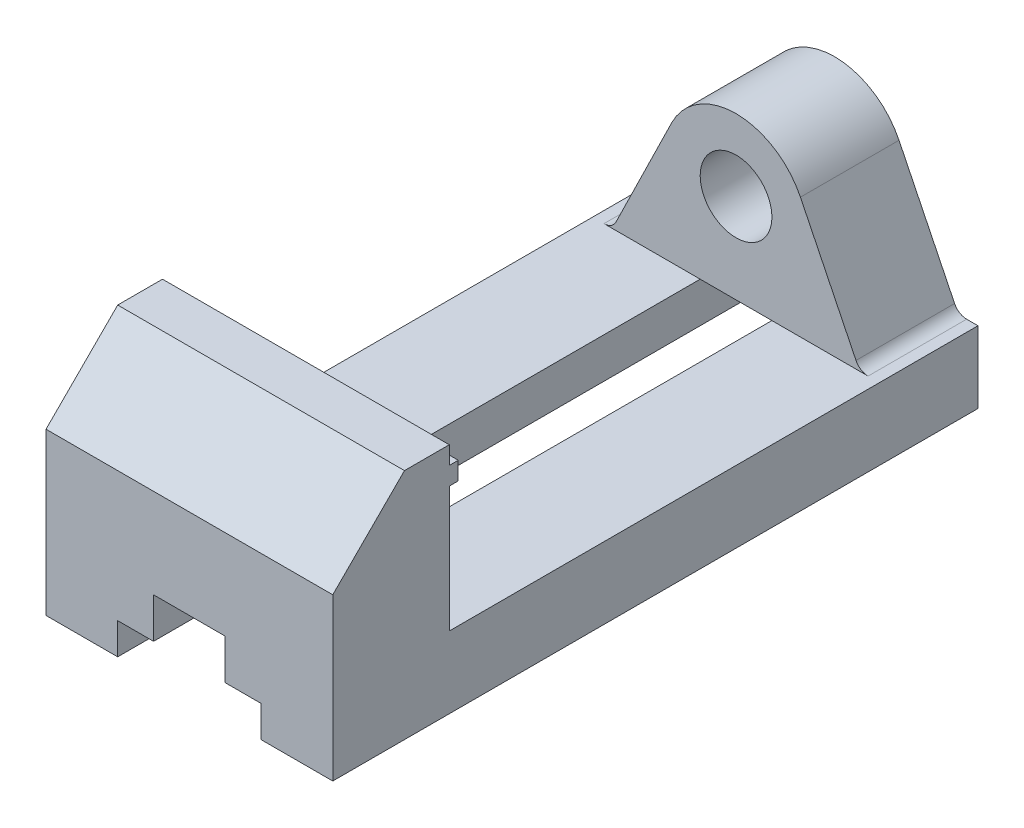
ISO-10303-21;
HEADER;
FILE_DESCRIPTION(('STEP AP214'),'2;1');
FILE_NAME('part.step','',(''),(''),'','','');
FILE_SCHEMA(('AUTOMOTIVE_DESIGN { 1 0 10303 214 1 1 1 1 }'));
ENDSEC;
DATA;
#1=APPLICATION_CONTEXT('core data for automotive mechanical design processes');
#2=APPLICATION_PROTOCOL_DEFINITION('international standard','automotive_design',2000,#1);
#3=PRODUCT_CONTEXT('',#1,'mechanical');
#4=PRODUCT('Part','Part','',(#3));
#5=PRODUCT_RELATED_PRODUCT_CATEGORY('part','',(#4));
#6=PRODUCT_DEFINITION_FORMATION('','',#4);
#7=PRODUCT_DEFINITION_CONTEXT('part definition',#1,'design');
#8=PRODUCT_DEFINITION('design','',#6,#7);
#9=PRODUCT_DEFINITION_SHAPE('','',#8);
#10=(LENGTH_UNIT() NAMED_UNIT(*) SI_UNIT(.MILLI.,.METRE.));
#11=(NAMED_UNIT(*) PLANE_ANGLE_UNIT() SI_UNIT($,.RADIAN.));
#12=(NAMED_UNIT(*) SI_UNIT($,.STERADIAN.) SOLID_ANGLE_UNIT());
#13=UNCERTAINTY_MEASURE_WITH_UNIT(LENGTH_MEASURE(1.E-05),#10,'distance_accuracy_value','');
#14=(GEOMETRIC_REPRESENTATION_CONTEXT(3) GLOBAL_UNCERTAINTY_ASSIGNED_CONTEXT((#13)) GLOBAL_UNIT_ASSIGNED_CONTEXT((#10,
#11,#12)) REPRESENTATION_CONTEXT('',''));
#15=CARTESIAN_POINT('',(0.,0.,0.));
#16=DIRECTION('',(0.,0.,1.));
#17=DIRECTION('',(1.,0.,0.));
#18=AXIS2_PLACEMENT_3D('',#15,#16,#17);
#19=CARTESIAN_POINT('',(32.,52.,-26.));
#20=DIRECTION('',(0.,0.,1.));
#21=DIRECTION('',(0.,-1.,0.));
#22=AXIS2_PLACEMENT_3D('',#19,#20,#21);
#23=PLANE('',#22);
#24=DIRECTION('',(-1.,0.,0.));
#25=VECTOR('',#24,1.);
#26=CARTESIAN_POINT('',(32.,44.,-26.));
#27=LINE('',#26,#25);
#28=CARTESIAN_POINT('',(32.,44.,-26.));
#29=VERTEX_POINT('',#28);
#30=CARTESIAN_POINT('',(-32.,44.,-26.));
#31=VERTEX_POINT('',#30);
#32=EDGE_CURVE('E86',#29,#31,#27,.T.);
#33=ORIENTED_EDGE('',*,*,#32,.F.);
#34=DIRECTION('',(0.,1.,0.));
#35=VECTOR('',#34,1.);
#36=CARTESIAN_POINT('',(32.,52.,-26.));
#37=LINE('',#36,#35);
#38=CARTESIAN_POINT('',(32.,16.,-26.));
#39=VERTEX_POINT('',#38);
#40=EDGE_CURVE('E287',#39,#29,#37,.T.);
#41=ORIENTED_EDGE('',*,*,#40,.F.);
#42=DIRECTION('',(-1.,0.,0.));
#43=VECTOR('',#42,1.);
#44=CARTESIAN_POINT('',(32.,16.,-26.));
#45=LINE('',#44,#43);
#46=CARTESIAN_POINT('',(8.,16.,-26.));
#47=VERTEX_POINT('',#46);
#48=EDGE_CURVE('E515',#39,#47,#45,.T.);
#49=ORIENTED_EDGE('',*,*,#48,.T.);
#50=DIRECTION('',(-1.,0.,0.));
#51=VECTOR('',#50,1.);
#52=CARTESIAN_POINT('',(32.,16.,-26.));
#53=LINE('',#52,#51);
#54=CARTESIAN_POINT('',(-8.,16.,-26.));
#55=VERTEX_POINT('',#54);
#56=EDGE_CURVE('E399',#47,#55,#53,.T.);
#57=ORIENTED_EDGE('',*,*,#56,.T.);
#58=CARTESIAN_POINT('',(-32.,16.,-26.));
#59=VERTEX_POINT('',#58);
#60=EDGE_CURVE('E514',#55,#59,#45,.T.);
#61=ORIENTED_EDGE('',*,*,#60,.T.);
#62=DIRECTION('',(0.,1.,0.));
#63=VECTOR('',#62,1.);
#64=CARTESIAN_POINT('',(-32.,52.,-26.));
#65=LINE('',#64,#63);
#66=EDGE_CURVE('E486',#59,#31,#65,.T.);
#67=ORIENTED_EDGE('',*,*,#66,.T.);
#68=EDGE_LOOP('',(#33,#41,#49,#57,#61,#67));
#69=FACE_BOUND('',#68,.T.);
#70=ADVANCED_FACE('F70',(#69),#23,.F.);
#71=DIRECTION('',(1.,0.,0.));
#72=VECTOR('',#71,1.);
#73=CARTESIAN_POINT('',(32.,48.,-26.));
#74=LINE('',#73,#72);
#75=CARTESIAN_POINT('',(-32.,48.,-26.));
#76=VERTEX_POINT('',#75);
#77=CARTESIAN_POINT('',(32.,48.,-26.));
#78=VERTEX_POINT('',#77);
#79=EDGE_CURVE('E94',#76,#78,#74,.T.);
#80=ORIENTED_EDGE('',*,*,#79,.F.);
#81=CARTESIAN_POINT('',(-32.,52.,-26.));
#82=VERTEX_POINT('',#81);
#83=EDGE_CURVE('E485',#76,#82,#65,.T.);
#84=ORIENTED_EDGE('',*,*,#83,.T.);
#85=DIRECTION('',(-1.,0.,0.));
#86=VECTOR('',#85,1.);
#87=CARTESIAN_POINT('',(32.,52.,-26.));
#88=LINE('',#87,#86);
#89=CARTESIAN_POINT('',(32.,52.,-26.));
#90=VERTEX_POINT('',#89);
#91=EDGE_CURVE('E510',#90,#82,#88,.T.);
#92=ORIENTED_EDGE('',*,*,#91,.F.);
#93=EDGE_CURVE('E461',#78,#90,#37,.T.);
#94=ORIENTED_EDGE('',*,*,#93,.F.);
#95=EDGE_LOOP('',(#80,#84,#92,#94));
#96=FACE_BOUND('',#95,.T.);
#97=ADVANCED_FACE('F661',(#96),#23,.F.);
#98=CARTESIAN_POINT('',(32.,52.,-144.));
#99=DIRECTION('',(0.,0.,1.));
#100=DIRECTION('',(1.,0.,0.));
#101=AXIS2_PLACEMENT_3D('',#98,#99,#100);
#102=PLANE('',#101);
#103=CARTESIAN_POINT('',(0.,36.,-144.));
#104=DIRECTION('',(0.,0.,-1.));
#105=DIRECTION('',(-1.,0.,0.));
#106=AXIS2_PLACEMENT_3D('',#103,#104,#105);
#107=CIRCLE('',#106,8.);
#108=CARTESIAN_POINT('',(-8.,36.,-144.));
#109=VERTEX_POINT('',#108);
#110=EDGE_CURVE('E328',#109,#109,#107,.T.);
#111=ORIENTED_EDGE('',*,*,#110,.F.);
#112=EDGE_LOOP('',(#111));
#113=FACE_BOUND('',#112,.T.);
#114=DIRECTION('',(1.,0.,0.));
#115=VECTOR('',#114,1.);
#116=CARTESIAN_POINT('',(0.,16.,-144.));
#117=LINE('',#116,#115);
#118=CARTESIAN_POINT('',(-32.,16.,-144.));
#119=VERTEX_POINT('',#118);
#120=CARTESIAN_POINT('',(-29.4689632222793,16.,-144.));
#121=VERTEX_POINT('',#120);
#122=EDGE_CURVE('E294',#119,#121,#117,.T.);
#123=ORIENTED_EDGE('',*,*,#122,.T.);
#124=CARTESIAN_POINT('',(-29.4689632222793,19.,-144.));
#125=DIRECTION('',(0.,0.,1.));
#126=DIRECTION('',(1.,0.,0.));
#127=AXIS2_PLACEMENT_3D('',#124,#125,#126);
#128=CIRCLE('',#127,3.);
#129=CARTESIAN_POINT('',(-26.7741783563797,17.6816166996969,-144.));
#130=VERTEX_POINT('',#129);
#131=EDGE_CURVE('E79',#121,#130,#128,.T.);
#132=ORIENTED_EDGE('',*,*,#131,.T.);
#133=DIRECTION('',(0.43946110010103,0.898261621966558,0.));
#134=VECTOR('',#133,1.);
#135=CARTESIAN_POINT('',(-28.5832234119115,13.9839157076888,-144.));
#136=LINE('',#135,#134);
#137=CARTESIAN_POINT('',(-14.3721859514649,43.0313776016165,-144.));
#138=VERTEX_POINT('',#137);
#139=EDGE_CURVE('E300',#130,#138,#136,.T.);
#140=ORIENTED_EDGE('',*,*,#139,.T.);
#141=CARTESIAN_POINT('',(0.,36.,-144.));
#142=DIRECTION('',(0.,0.,-1.));
#143=DIRECTION('',(-1.,0.,0.));
#144=AXIS2_PLACEMENT_3D('',#141,#142,#143);
#145=CIRCLE('',#144,16.);
#146=CARTESIAN_POINT('',(14.3721859514649,43.0313776016165,-144.));
#147=VERTEX_POINT('',#146);
#148=EDGE_CURVE('E319',#138,#147,#145,.T.);
#149=ORIENTED_EDGE('',*,*,#148,.T.);
#150=DIRECTION('',(-0.43946110010103,0.898261621966558,0.));
#151=VECTOR('',#150,1.);
#152=CARTESIAN_POINT('',(28.5832234119115,13.9839157076888,-144.));
#153=LINE('',#152,#151);
#154=CARTESIAN_POINT('',(26.7741783563797,17.6816166996969,-144.));
#155=VERTEX_POINT('',#154);
#156=EDGE_CURVE('E311',#155,#147,#153,.T.);
#157=ORIENTED_EDGE('',*,*,#156,.F.);
#158=CARTESIAN_POINT('',(29.4689632222793,19.,-144.));
#159=DIRECTION('',(0.,0.,1.));
#160=DIRECTION('',(1.,0.,0.));
#161=AXIS2_PLACEMENT_3D('',#158,#159,#160);
#162=CIRCLE('',#161,3.);
#163=CARTESIAN_POINT('',(29.4689632222793,16.,-144.));
#164=VERTEX_POINT('',#163);
#165=EDGE_CURVE('E559',#155,#164,#162,.T.);
#166=ORIENTED_EDGE('',*,*,#165,.T.);
#167=DIRECTION('',(1.,0.,0.));
#168=VECTOR('',#167,1.);
#169=CARTESIAN_POINT('',(0.,16.,-144.));
#170=LINE('',#169,#168);
#171=CARTESIAN_POINT('',(32.,16.,-144.));
#172=VERTEX_POINT('',#171);
#173=EDGE_CURVE('E315',#164,#172,#170,.T.);
#174=ORIENTED_EDGE('',*,*,#173,.T.);
#175=DIRECTION('',(0.,1.,0.));
#176=VECTOR('',#175,1.);
#177=CARTESIAN_POINT('',(32.,52.,-144.));
#178=LINE('',#177,#176);
#179=CARTESIAN_POINT('',(32.,0.,-144.));
#180=VERTEX_POINT('',#179);
#181=EDGE_CURVE('E454',#180,#172,#178,.T.);
#182=ORIENTED_EDGE('',*,*,#181,.F.);
#183=DIRECTION('',(-1.,0.,0.));
#184=VECTOR('',#183,1.);
#185=CARTESIAN_POINT('',(32.,0.,-144.));
#186=LINE('',#185,#184);
#187=CARTESIAN_POINT('',(16.,0.,-144.));
#188=VERTEX_POINT('',#187);
#189=EDGE_CURVE('E524',#180,#188,#186,.T.);
#190=ORIENTED_EDGE('',*,*,#189,.T.);
#191=DIRECTION('',(0.,1.,0.));
#192=VECTOR('',#191,1.);
#193=CARTESIAN_POINT('',(16.,7.,-144.));
#194=LINE('',#193,#192);
#195=CARTESIAN_POINT('',(16.,7.,-144.));
#196=VERTEX_POINT('',#195);
#197=EDGE_CURVE('E340',#188,#196,#194,.T.);
#198=ORIENTED_EDGE('',*,*,#197,.T.);
#199=DIRECTION('',(-1.,0.,0.));
#200=VECTOR('',#199,1.);
#201=CARTESIAN_POINT('',(8.,7.,-144.));
#202=LINE('',#201,#200);
#203=CARTESIAN_POINT('',(8.,7.,-144.));
#204=VERTEX_POINT('',#203);
#205=EDGE_CURVE('E344',#196,#204,#202,.T.);
#206=ORIENTED_EDGE('',*,*,#205,.T.);
#207=DIRECTION('',(0.,1.,0.));
#208=VECTOR('',#207,1.);
#209=CARTESIAN_POINT('',(8.,16.,-144.));
#210=LINE('',#209,#208);
#211=CARTESIAN_POINT('',(8.,16.,-144.));
#212=VERTEX_POINT('',#211);
#213=EDGE_CURVE('E349',#204,#212,#210,.T.);
#214=ORIENTED_EDGE('',*,*,#213,.T.);
#215=DIRECTION('',(-1.,0.,0.));
#216=VECTOR('',#215,1.);
#217=CARTESIAN_POINT('',(0.,16.,-144.));
#218=LINE('',#217,#216);
#219=CARTESIAN_POINT('',(-8.,16.,-144.));
#220=VERTEX_POINT('',#219);
#221=EDGE_CURVE('E353',#212,#220,#218,.T.);
#222=ORIENTED_EDGE('',*,*,#221,.T.);
#223=DIRECTION('',(0.,-1.,0.));
#224=VECTOR('',#223,1.);
#225=CARTESIAN_POINT('',(-8.,7.,-144.));
#226=LINE('',#225,#224);
#227=CARTESIAN_POINT('',(-8.,7.,-144.));
#228=VERTEX_POINT('',#227);
#229=EDGE_CURVE('E357',#220,#228,#226,.T.);
#230=ORIENTED_EDGE('',*,*,#229,.T.);
#231=DIRECTION('',(-1.,0.,0.));
#232=VECTOR('',#231,1.);
#233=CARTESIAN_POINT('',(-16.,7.,-144.));
#234=LINE('',#233,#232);
#235=CARTESIAN_POINT('',(-16.,7.,-144.));
#236=VERTEX_POINT('',#235);
#237=EDGE_CURVE('E361',#228,#236,#234,.T.);
#238=ORIENTED_EDGE('',*,*,#237,.T.);
#239=DIRECTION('',(0.,-1.,0.));
#240=VECTOR('',#239,1.);
#241=CARTESIAN_POINT('',(-16.,0.,-144.));
#242=LINE('',#241,#240);
#243=CARTESIAN_POINT('',(-16.,0.,-144.));
#244=VERTEX_POINT('',#243);
#245=EDGE_CURVE('E365',#236,#244,#242,.T.);
#246=ORIENTED_EDGE('',*,*,#245,.T.);
#247=CARTESIAN_POINT('',(-32.,0.,-144.));
#248=VERTEX_POINT('',#247);
#249=EDGE_CURVE('E523',#244,#248,#186,.T.);
#250=ORIENTED_EDGE('',*,*,#249,.T.);
#251=DIRECTION('',(0.,1.,0.));
#252=VECTOR('',#251,1.);
#253=CARTESIAN_POINT('',(-32.,52.,-144.));
#254=LINE('',#253,#252);
#255=EDGE_CURVE('E477',#248,#119,#254,.T.);
#256=ORIENTED_EDGE('',*,*,#255,.T.);
#257=EDGE_LOOP('',(#123,#132,#140,#149,#157,#166,#174,#182,#190,#198,#206,#214,#222,#230,#238,
#246,#250,#256));
#258=FACE_BOUND('',#257,.T.);
#259=ADVANCED_FACE('F567',(#113,#258),#102,.F.);
#260=CARTESIAN_POINT('',(32.,16.,-122.));
#261=DIRECTION('',(0.,0.,-1.));
#262=DIRECTION('',(-1.,0.,0.));
#263=AXIS2_PLACEMENT_3D('',#260,#261,#262);
#264=PLANE('',#263);
#265=CARTESIAN_POINT('',(0.,36.,-122.));
#266=DIRECTION('',(0.,0.,-1.));
#267=DIRECTION('',(-1.,0.,0.));
#268=AXIS2_PLACEMENT_3D('',#265,#266,#267);
#269=CIRCLE('',#268,8.);
#270=CARTESIAN_POINT('',(-8.,36.,-122.));
#271=VERTEX_POINT('',#270);
#272=EDGE_CURVE('E332',#271,#271,#269,.F.);
#273=ORIENTED_EDGE('',*,*,#272,.F.);
#274=EDGE_LOOP('',(#273));
#275=FACE_BOUND('',#274,.T.);
#276=CARTESIAN_POINT('',(0.,36.,-122.));
#277=DIRECTION('',(0.,0.,-1.));
#278=DIRECTION('',(-1.,0.,0.));
#279=AXIS2_PLACEMENT_3D('',#276,#277,#278);
#280=CIRCLE('',#279,16.);
#281=CARTESIAN_POINT('',(14.3721859514649,43.0313776016165,-122.));
#282=VERTEX_POINT('',#281);
#283=CARTESIAN_POINT('',(-14.3721859514649,43.0313776016165,-122.));
#284=VERTEX_POINT('',#283);
#285=EDGE_CURVE('E303',#282,#284,#280,.F.);
#286=ORIENTED_EDGE('',*,*,#285,.T.);
#287=DIRECTION('',(-0.43946110010103,-0.898261621966558,0.));
#288=VECTOR('',#287,1.);
#289=CARTESIAN_POINT('',(-28.5832234119115,13.9839157076888,-122.));
#290=LINE('',#289,#288);
#291=CARTESIAN_POINT('',(-26.7741783563797,17.6816166996969,-122.));
#292=VERTEX_POINT('',#291);
#293=EDGE_CURVE('E304',#284,#292,#290,.T.);
#294=ORIENTED_EDGE('',*,*,#293,.T.);
#295=CARTESIAN_POINT('',(-29.4689632222793,19.,-122.));
#296=DIRECTION('',(0.,0.,-1.));
#297=DIRECTION('',(-1.,0.,0.));
#298=AXIS2_PLACEMENT_3D('',#295,#296,#297);
#299=CIRCLE('',#298,3.);
#300=CARTESIAN_POINT('',(-29.4689632222793,16.,-122.));
#301=VERTEX_POINT('',#300);
#302=EDGE_CURVE('E12',#292,#301,#299,.T.);
#303=ORIENTED_EDGE('',*,*,#302,.T.);
#304=DIRECTION('',(-1.,0.,0.));
#305=VECTOR('',#304,1.);
#306=CARTESIAN_POINT('',(32.,16.,-122.));
#307=LINE('',#306,#305);
#308=CARTESIAN_POINT('',(-8.,16.,-122.));
#309=VERTEX_POINT('',#308);
#310=EDGE_CURVE('E519',#309,#301,#307,.T.);
#311=ORIENTED_EDGE('',*,*,#310,.F.);
#312=DIRECTION('',(1.,0.,0.));
#313=VECTOR('',#312,1.);
#314=CARTESIAN_POINT('',(32.,16.,-122.));
#315=LINE('',#314,#313);
#316=CARTESIAN_POINT('',(8.,16.,-122.));
#317=VERTEX_POINT('',#316);
#318=EDGE_CURVE('E429',#309,#317,#315,.T.);
#319=ORIENTED_EDGE('',*,*,#318,.T.);
#320=CARTESIAN_POINT('',(29.4689632222793,16.,-122.));
#321=VERTEX_POINT('',#320);
#322=EDGE_CURVE('E520',#321,#317,#307,.T.);
#323=ORIENTED_EDGE('',*,*,#322,.F.);
#324=CARTESIAN_POINT('',(29.4689632222793,19.,-122.));
#325=DIRECTION('',(0.,0.,-1.));
#326=DIRECTION('',(-1.,0.,0.));
#327=AXIS2_PLACEMENT_3D('',#324,#325,#326);
#328=CIRCLE('',#327,3.);
#329=CARTESIAN_POINT('',(26.7741783563797,17.6816166996969,-122.));
#330=VERTEX_POINT('',#329);
#331=EDGE_CURVE('E562',#321,#330,#328,.T.);
#332=ORIENTED_EDGE('',*,*,#331,.T.);
#333=DIRECTION('',(0.43946110010103,-0.898261621966558,0.));
#334=VECTOR('',#333,1.);
#335=CARTESIAN_POINT('',(28.5832234119115,13.9839157076888,-122.));
#336=LINE('',#335,#334);
#337=EDGE_CURVE('E314',#282,#330,#336,.T.);
#338=ORIENTED_EDGE('',*,*,#337,.F.);
#339=EDGE_LOOP('',(#286,#294,#303,#311,#319,#323,#332,#338));
#340=FACE_BOUND('',#339,.T.);
#341=ADVANCED_FACE('F580',(#275,#340),#264,.F.);
#342=CARTESIAN_POINT('',(-32.,0.,0.));
#343=DIRECTION('',(-1.,0.,0.));
#344=DIRECTION('',(0.,0.,1.));
#345=AXIS2_PLACEMENT_3D('',#342,#343,#344);
#346=PLANE('',#345);
#347=DIRECTION('',(0.,0.,1.));
#348=VECTOR('',#347,1.);
#349=CARTESIAN_POINT('',(-32.,16.,-26.));
#350=LINE('',#349,#348);
#351=EDGE_CURVE('E481',#119,#59,#350,.T.);
#352=ORIENTED_EDGE('',*,*,#351,.F.);
#353=ORIENTED_EDGE('',*,*,#255,.F.);
#354=DIRECTION('',(0.,0.,-1.));
#355=VECTOR('',#354,1.);
#356=CARTESIAN_POINT('',(-32.,0.,-144.));
#357=LINE('',#356,#355);
#358=CARTESIAN_POINT('',(-32.,0.,0.));
#359=VERTEX_POINT('',#358);
#360=EDGE_CURVE('E449',#359,#248,#357,.T.);
#361=ORIENTED_EDGE('',*,*,#360,.F.);
#362=DIRECTION('',(0.,-1.,0.));
#363=VECTOR('',#362,1.);
#364=CARTESIAN_POINT('',(-32.,0.,0.));
#365=LINE('',#364,#363);
#366=CARTESIAN_POINT('',(-32.,36.,0.));
#367=VERTEX_POINT('',#366);
#368=EDGE_CURVE('E455',#367,#359,#365,.T.);
#369=ORIENTED_EDGE('',*,*,#368,.F.);
#370=DIRECTION('',(0.,-0.707106781186548,0.707106781186548));
#371=VECTOR('',#370,1.);
#372=CARTESIAN_POINT('',(-32.,36.,0.));
#373=LINE('',#372,#371);
#374=CARTESIAN_POINT('',(-32.,52.,-16.));
#375=VERTEX_POINT('',#374);
#376=EDGE_CURVE('E492',#375,#367,#373,.T.);
#377=ORIENTED_EDGE('',*,*,#376,.F.);
#378=DIRECTION('',(0.,0.,1.));
#379=VECTOR('',#378,1.);
#380=CARTESIAN_POINT('',(-32.,52.,-16.));
#381=LINE('',#380,#379);
#382=EDGE_CURVE('E489',#82,#375,#381,.T.);
#383=ORIENTED_EDGE('',*,*,#382,.F.);
#384=ORIENTED_EDGE('',*,*,#83,.F.);
#385=DIRECTION('',(0.,0.,1.));
#386=VECTOR('',#385,1.);
#387=CARTESIAN_POINT('',(-32.,48.,-28.));
#388=LINE('',#387,#386);
#389=CARTESIAN_POINT('',(-32.,48.,-28.));
#390=VERTEX_POINT('',#389);
#391=EDGE_CURVE('E296',#390,#76,#388,.T.);
#392=ORIENTED_EDGE('',*,*,#391,.F.);
#393=DIRECTION('',(0.,1.,0.));
#394=VECTOR('',#393,1.);
#395=CARTESIAN_POINT('',(-32.,48.,-28.));
#396=LINE('',#395,#394);
#397=CARTESIAN_POINT('',(-32.,44.,-28.));
#398=VERTEX_POINT('',#397);
#399=EDGE_CURVE('E273',#398,#390,#396,.T.);
#400=ORIENTED_EDGE('',*,*,#399,.F.);
#401=DIRECTION('',(0.,0.,1.));
#402=VECTOR('',#401,1.);
#403=CARTESIAN_POINT('',(-32.,44.,-28.));
#404=LINE('',#403,#402);
#405=EDGE_CURVE('E269',#398,#31,#404,.T.);
#406=ORIENTED_EDGE('',*,*,#405,.T.);
#407=ORIENTED_EDGE('',*,*,#66,.F.);
#408=EDGE_LOOP('',(#352,#353,#361,#369,#377,#383,#384,#392,#400,#406,#407));
#409=FACE_BOUND('',#408,.T.);
#410=ADVANCED_FACE('F674',(#409),#346,.T.);
#411=CARTESIAN_POINT('',(32.,0.,0.));
#412=DIRECTION('',(-1.,0.,0.));
#413=DIRECTION('',(0.,0.,1.));
#414=AXIS2_PLACEMENT_3D('',#411,#412,#413);
#415=PLANE('',#414);
#416=ORIENTED_EDGE('',*,*,#181,.T.);
#417=DIRECTION('',(0.,0.,1.));
#418=VECTOR('',#417,1.);
#419=CARTESIAN_POINT('',(32.,16.,-26.));
#420=LINE('',#419,#418);
#421=EDGE_CURVE('E458',#172,#39,#420,.T.);
#422=ORIENTED_EDGE('',*,*,#421,.T.);
#423=ORIENTED_EDGE('',*,*,#40,.T.);
#424=DIRECTION('',(0.,0.,1.));
#425=VECTOR('',#424,1.);
#426=CARTESIAN_POINT('',(32.,44.,-28.));
#427=LINE('',#426,#425);
#428=CARTESIAN_POINT('',(32.,44.,-28.));
#429=VERTEX_POINT('',#428);
#430=EDGE_CURVE('E267',#429,#29,#427,.T.);
#431=ORIENTED_EDGE('',*,*,#430,.F.);
#432=DIRECTION('',(0.,-1.,0.));
#433=VECTOR('',#432,1.);
#434=CARTESIAN_POINT('',(32.,48.,-28.));
#435=LINE('',#434,#433);
#436=CARTESIAN_POINT('',(32.,48.,-28.));
#437=VERTEX_POINT('',#436);
#438=EDGE_CURVE('E274',#437,#429,#435,.T.);
#439=ORIENTED_EDGE('',*,*,#438,.F.);
#440=DIRECTION('',(0.,0.,1.));
#441=VECTOR('',#440,1.);
#442=CARTESIAN_POINT('',(32.,48.,-28.));
#443=LINE('',#442,#441);
#444=EDGE_CURVE('E773',#437,#78,#443,.T.);
#445=ORIENTED_EDGE('',*,*,#444,.T.);
#446=ORIENTED_EDGE('',*,*,#93,.T.);
#447=DIRECTION('',(0.,0.,1.));
#448=VECTOR('',#447,1.);
#449=CARTESIAN_POINT('',(32.,52.,-16.));
#450=LINE('',#449,#448);
#451=CARTESIAN_POINT('',(32.,52.,-16.));
#452=VERTEX_POINT('',#451);
#453=EDGE_CURVE('E464',#90,#452,#450,.T.);
#454=ORIENTED_EDGE('',*,*,#453,.T.);
#455=DIRECTION('',(0.,-0.707106781186548,0.707106781186548));
#456=VECTOR('',#455,1.);
#457=CARTESIAN_POINT('',(32.,36.,0.));
#458=LINE('',#457,#456);
#459=CARTESIAN_POINT('',(32.,36.,0.));
#460=VERTEX_POINT('',#459);
#461=EDGE_CURVE('E467',#452,#460,#458,.T.);
#462=ORIENTED_EDGE('',*,*,#461,.T.);
#463=DIRECTION('',(0.,-1.,0.));
#464=VECTOR('',#463,1.);
#465=CARTESIAN_POINT('',(32.,0.,0.));
#466=LINE('',#465,#464);
#467=CARTESIAN_POINT('',(32.,0.,0.));
#468=VERTEX_POINT('',#467);
#469=EDGE_CURVE('E470',#460,#468,#466,.T.);
#470=ORIENTED_EDGE('',*,*,#469,.T.);
#471=DIRECTION('',(0.,0.,-1.));
#472=VECTOR('',#471,1.);
#473=CARTESIAN_POINT('',(32.,0.,-144.));
#474=LINE('',#473,#472);
#475=EDGE_CURVE('E450',#468,#180,#474,.T.);
#476=ORIENTED_EDGE('',*,*,#475,.T.);
#477=EDGE_LOOP('',(#416,#422,#423,#431,#439,#445,#446,#454,#462,#470,#476));
#478=FACE_BOUND('',#477,.T.);
#479=ADVANCED_FACE('F286',(#478),#415,.F.);
#480=CARTESIAN_POINT('',(32.,0.,-144.));
#481=DIRECTION('',(0.,1.,0.));
#482=DIRECTION('',(0.,0.,1.));
#483=AXIS2_PLACEMENT_3D('',#480,#481,#482);
#484=PLANE('',#483);
#485=CARTESIAN_POINT('',(-22.,0.,-36.));
#486=DIRECTION('',(0.,1.,0.));
#487=DIRECTION('',(0.,0.,1.));
#488=AXIS2_PLACEMENT_3D('',#485,#486,#487);
#489=CIRCLE('',#488,3.);
#490=CARTESIAN_POINT('',(-22.,0.,-33.));
#491=VERTEX_POINT('',#490);
#492=EDGE_CURVE('E445',#491,#491,#489,.T.);
#493=ORIENTED_EDGE('',*,*,#492,.T.);
#494=EDGE_LOOP('',(#493));
#495=FACE_BOUND('',#494,.T.);
#496=CARTESIAN_POINT('',(-22.,0.,-106.));
#497=DIRECTION('',(0.,1.,0.));
#498=DIRECTION('',(0.,0.,1.));
#499=AXIS2_PLACEMENT_3D('',#496,#497,#498);
#500=CIRCLE('',#499,3.);
#501=CARTESIAN_POINT('',(-22.,0.,-103.));
#502=VERTEX_POINT('',#501);
#503=EDGE_CURVE('E437',#502,#502,#500,.T.);
#504=ORIENTED_EDGE('',*,*,#503,.T.);
#505=EDGE_LOOP('',(#504));
#506=FACE_BOUND('',#505,.T.);
#507=ORIENTED_EDGE('',*,*,#249,.F.);
#508=DIRECTION('',(0.,0.,1.));
#509=VECTOR('',#508,1.);
#510=CARTESIAN_POINT('',(-16.,0.,-144.));
#511=LINE('',#510,#509);
#512=CARTESIAN_POINT('',(-16.,0.,0.));
#513=VERTEX_POINT('',#512);
#514=EDGE_CURVE('E395',#244,#513,#511,.T.);
#515=ORIENTED_EDGE('',*,*,#514,.T.);
#516=DIRECTION('',(-1.,0.,0.));
#517=VECTOR('',#516,1.);
#518=CARTESIAN_POINT('',(32.,0.,0.));
#519=LINE('',#518,#517);
#520=EDGE_CURVE('E473',#513,#359,#519,.T.);
#521=ORIENTED_EDGE('',*,*,#520,.T.);
#522=ORIENTED_EDGE('',*,*,#360,.T.);
#523=EDGE_LOOP('',(#507,#515,#521,#522));
#524=FACE_BOUND('',#523,.T.);
#525=ADVANCED_FACE('F641',(#495,#506,#524),#484,.F.);
#526=CARTESIAN_POINT('',(32.,16.,-26.));
#527=DIRECTION('',(0.,-1.,0.));
#528=DIRECTION('',(0.,0.,-1.));
#529=AXIS2_PLACEMENT_3D('',#526,#527,#528);
#530=PLANE('',#529);
#531=ORIENTED_EDGE('',*,*,#310,.T.);
#532=DIRECTION('',(0.,0.,-1.));
#533=VECTOR('',#532,1.);
#534=CARTESIAN_POINT('',(-29.4689632222793,16.,-26.));
#535=LINE('',#534,#533);
#536=EDGE_CURVE('E552',#301,#121,#535,.T.);
#537=ORIENTED_EDGE('',*,*,#536,.T.);
#538=ORIENTED_EDGE('',*,*,#122,.F.);
#539=ORIENTED_EDGE('',*,*,#351,.T.);
#540=ORIENTED_EDGE('',*,*,#60,.F.);
#541=DIRECTION('',(0.,0.,1.));
#542=VECTOR('',#541,1.);
#543=CARTESIAN_POINT('',(-8.,16.,-144.));
#544=LINE('',#543,#542);
#545=EDGE_CURVE('E410',#309,#55,#544,.T.);
#546=ORIENTED_EDGE('',*,*,#545,.F.);
#547=EDGE_LOOP('',(#531,#537,#538,#539,#540,#546));
#548=FACE_BOUND('',#547,.T.);
#549=ADVANCED_FACE('F657',(#548),#530,.F.);
#550=CARTESIAN_POINT('',(16.,0.,0.));
#551=VERTEX_POINT('',#550);
#552=EDGE_CURVE('E498',#468,#551,#519,.T.);
#553=ORIENTED_EDGE('',*,*,#552,.T.);
#554=DIRECTION('',(0.,0.,1.));
#555=VECTOR('',#554,1.);
#556=CARTESIAN_POINT('',(16.,0.,-144.));
#557=LINE('',#556,#555);
#558=EDGE_CURVE('E369',#188,#551,#557,.T.);
#559=ORIENTED_EDGE('',*,*,#558,.F.);
#560=ORIENTED_EDGE('',*,*,#189,.F.);
#561=ORIENTED_EDGE('',*,*,#475,.F.);
#562=EDGE_LOOP('',(#553,#559,#560,#561));
#563=FACE_BOUND('',#562,.T.);
#564=CARTESIAN_POINT('',(22.,0.,-36.));
#565=DIRECTION('',(0.,1.,0.));
#566=DIRECTION('',(0.,0.,1.));
#567=AXIS2_PLACEMENT_3D('',#564,#565,#566);
#568=CIRCLE('',#567,3.);
#569=CARTESIAN_POINT('',(22.,0.,-33.));
#570=VERTEX_POINT('',#569);
#571=EDGE_CURVE('E441',#570,#570,#568,.T.);
#572=ORIENTED_EDGE('',*,*,#571,.T.);
#573=EDGE_LOOP('',(#572));
#574=FACE_BOUND('',#573,.T.);
#575=CARTESIAN_POINT('',(22.,0.,-106.));
#576=DIRECTION('',(0.,1.,0.));
#577=DIRECTION('',(0.,0.,1.));
#578=AXIS2_PLACEMENT_3D('',#575,#576,#577);
#579=CIRCLE('',#578,3.);
#580=CARTESIAN_POINT('',(22.,0.,-103.));
#581=VERTEX_POINT('',#580);
#582=EDGE_CURVE('E433',#581,#581,#579,.T.);
#583=ORIENTED_EDGE('',*,*,#582,.T.);
#584=EDGE_LOOP('',(#583));
#585=FACE_BOUND('',#584,.T.);
#586=ADVANCED_FACE('F606',(#563,#574,#585),#484,.F.);
#587=ORIENTED_EDGE('',*,*,#173,.F.);
#588=DIRECTION('',(0.,0.,-1.));
#589=VECTOR('',#588,1.);
#590=CARTESIAN_POINT('',(29.4689632222793,16.,-122.));
#591=LINE('',#590,#589);
#592=EDGE_CURVE('E548',#164,#321,#591,.F.);
#593=ORIENTED_EDGE('',*,*,#592,.T.);
#594=ORIENTED_EDGE('',*,*,#322,.T.);
#595=DIRECTION('',(0.,0.,1.));
#596=VECTOR('',#595,1.);
#597=CARTESIAN_POINT('',(8.,16.,-144.));
#598=LINE('',#597,#596);
#599=EDGE_CURVE('E416',#317,#47,#598,.T.);
#600=ORIENTED_EDGE('',*,*,#599,.T.);
#601=ORIENTED_EDGE('',*,*,#48,.F.);
#602=ORIENTED_EDGE('',*,*,#421,.F.);
#603=EDGE_LOOP('',(#587,#593,#594,#600,#601,#602));
#604=FACE_BOUND('',#603,.T.);
#605=ADVANCED_FACE('F595',(#604),#530,.F.);
#606=CARTESIAN_POINT('',(32.,52.,-16.));
#607=DIRECTION('',(0.,-1.,0.));
#608=DIRECTION('',(0.,0.,-1.));
#609=AXIS2_PLACEMENT_3D('',#606,#607,#608);
#610=PLANE('',#609);
#611=ORIENTED_EDGE('',*,*,#382,.T.);
#612=DIRECTION('',(-1.,0.,0.));
#613=VECTOR('',#612,1.);
#614=CARTESIAN_POINT('',(32.,52.,-16.));
#615=LINE('',#614,#613);
#616=EDGE_CURVE('E506',#452,#375,#615,.T.);
#617=ORIENTED_EDGE('',*,*,#616,.F.);
#618=ORIENTED_EDGE('',*,*,#453,.F.);
#619=ORIENTED_EDGE('',*,*,#91,.T.);
#620=EDGE_LOOP('',(#611,#617,#618,#619));
#621=FACE_BOUND('',#620,.T.);
#622=ADVANCED_FACE('F668',(#621),#610,.F.);
#623=CARTESIAN_POINT('',(32.,36.,0.));
#624=DIRECTION('',(0.,-0.707106781186547,-0.707106781186547));
#625=DIRECTION('',(0.,0.707106781186548,-0.707106781186548));
#626=AXIS2_PLACEMENT_3D('',#623,#624,#625);
#627=PLANE('',#626);
#628=ORIENTED_EDGE('',*,*,#376,.T.);
#629=DIRECTION('',(-1.,0.,0.));
#630=VECTOR('',#629,1.);
#631=CARTESIAN_POINT('',(32.,36.,0.));
#632=LINE('',#631,#630);
#633=EDGE_CURVE('E502',#460,#367,#632,.T.);
#634=ORIENTED_EDGE('',*,*,#633,.F.);
#635=ORIENTED_EDGE('',*,*,#461,.F.);
#636=ORIENTED_EDGE('',*,*,#616,.T.);
#637=EDGE_LOOP('',(#628,#634,#635,#636));
#638=FACE_BOUND('',#637,.T.);
#639=ADVANCED_FACE('F751',(#638),#627,.F.);
#640=CARTESIAN_POINT('',(32.,0.,0.));
#641=DIRECTION('',(0.,0.,-1.));
#642=DIRECTION('',(-1.,0.,0.));
#643=AXIS2_PLACEMENT_3D('',#640,#641,#642);
#644=PLANE('',#643);
#645=ORIENTED_EDGE('',*,*,#520,.F.);
#646=DIRECTION('',(0.,-1.,0.));
#647=VECTOR('',#646,1.);
#648=CARTESIAN_POINT('',(-16.,0.,0.));
#649=LINE('',#648,#647);
#650=CARTESIAN_POINT('',(-16.,7.,0.));
#651=VERTEX_POINT('',#650);
#652=EDGE_CURVE('E345',#651,#513,#649,.T.);
#653=ORIENTED_EDGE('',*,*,#652,.F.);
#654=DIRECTION('',(-1.,0.,0.));
#655=VECTOR('',#654,1.);
#656=CARTESIAN_POINT('',(-16.,7.,0.));
#657=LINE('',#656,#655);
#658=CARTESIAN_POINT('',(-8.,7.,0.));
#659=VERTEX_POINT('',#658);
#660=EDGE_CURVE('E389',#659,#651,#657,.T.);
#661=ORIENTED_EDGE('',*,*,#660,.F.);
#662=DIRECTION('',(0.,-1.,0.));
#663=VECTOR('',#662,1.);
#664=CARTESIAN_POINT('',(-8.,7.,0.));
#665=LINE('',#664,#663);
#666=CARTESIAN_POINT('',(-8.,16.,0.));
#667=VERTEX_POINT('',#666);
#668=EDGE_CURVE('E385',#667,#659,#665,.T.);
#669=ORIENTED_EDGE('',*,*,#668,.F.);
#670=DIRECTION('',(-1.,0.,0.));
#671=VECTOR('',#670,1.);
#672=CARTESIAN_POINT('',(-8.,16.,0.));
#673=LINE('',#672,#671);
#674=CARTESIAN_POINT('',(8.,16.,0.));
#675=VERTEX_POINT('',#674);
#676=EDGE_CURVE('E381',#675,#667,#673,.T.);
#677=ORIENTED_EDGE('',*,*,#676,.F.);
#678=DIRECTION('',(0.,1.,0.));
#679=VECTOR('',#678,1.);
#680=CARTESIAN_POINT('',(8.,16.,0.));
#681=LINE('',#680,#679);
#682=CARTESIAN_POINT('',(8.,7.,0.));
#683=VERTEX_POINT('',#682);
#684=EDGE_CURVE('E377',#683,#675,#681,.T.);
#685=ORIENTED_EDGE('',*,*,#684,.F.);
#686=DIRECTION('',(-1.,0.,0.));
#687=VECTOR('',#686,1.);
#688=CARTESIAN_POINT('',(8.,7.,0.));
#689=LINE('',#688,#687);
#690=CARTESIAN_POINT('',(16.,7.,0.));
#691=VERTEX_POINT('',#690);
#692=EDGE_CURVE('E373',#691,#683,#689,.T.);
#693=ORIENTED_EDGE('',*,*,#692,.F.);
#694=DIRECTION('',(0.,1.,0.));
#695=VECTOR('',#694,1.);
#696=CARTESIAN_POINT('',(16.,7.,0.));
#697=LINE('',#696,#695);
#698=EDGE_CURVE('E336',#551,#691,#697,.T.);
#699=ORIENTED_EDGE('',*,*,#698,.F.);
#700=ORIENTED_EDGE('',*,*,#552,.F.);
#701=ORIENTED_EDGE('',*,*,#469,.F.);
#702=ORIENTED_EDGE('',*,*,#633,.T.);
#703=ORIENTED_EDGE('',*,*,#368,.T.);
#704=EDGE_LOOP('',(#645,#653,#661,#669,#677,#685,#693,#699,#700,#701,#702,#703));
#705=FACE_BOUND('',#704,.T.);
#706=ADVANCED_FACE('F614',(#705),#644,.F.);
#707=CARTESIAN_POINT('',(-22.,10.,-36.));
#708=DIRECTION('',(0.,-1.,0.));
#709=DIRECTION('',(0.,0.,-1.));
#710=AXIS2_PLACEMENT_3D('',#707,#708,#709);
#711=CYLINDRICAL_SURFACE('',#710,3.);
#712=CARTESIAN_POINT('',(-22.,6.99999999999997,-36.));
#713=DIRECTION('',(0.,1.,0.));
#714=DIRECTION('',(0.,0.,1.));
#715=AXIS2_PLACEMENT_3D('',#712,#713,#714);
#716=CIRCLE('',#715,3.);
#717=CARTESIAN_POINT('',(-22.,6.99999999999997,-33.));
#718=VERTEX_POINT('',#717);
#719=EDGE_CURVE('E540',#718,#718,#716,.T.);
#720=ORIENTED_EDGE('',*,*,#719,.T.);
#721=EDGE_LOOP('',(#720));
#722=FACE_BOUND('',#721,.T.);
#723=ORIENTED_EDGE('',*,*,#492,.F.);
#724=EDGE_LOOP('',(#723));
#725=FACE_BOUND('',#724,.T.);
#726=ADVANCED_FACE('F740',(#722,#725),#711,.F.);
#727=CARTESIAN_POINT('',(22.,10.,-36.));
#728=DIRECTION('',(0.,-1.,0.));
#729=DIRECTION('',(0.,0.,-1.));
#730=AXIS2_PLACEMENT_3D('',#727,#728,#729);
#731=CYLINDRICAL_SURFACE('',#730,3.);
#732=CARTESIAN_POINT('',(22.,6.99999999999997,-36.));
#733=DIRECTION('',(0.,1.,0.));
#734=DIRECTION('',(0.,0.,1.));
#735=AXIS2_PLACEMENT_3D('',#732,#733,#734);
#736=CIRCLE('',#735,3.);
#737=CARTESIAN_POINT('',(22.,6.99999999999997,-33.));
#738=VERTEX_POINT('',#737);
#739=EDGE_CURVE('E536',#738,#738,#736,.T.);
#740=ORIENTED_EDGE('',*,*,#739,.T.);
#741=EDGE_LOOP('',(#740));
#742=FACE_BOUND('',#741,.T.);
#743=ORIENTED_EDGE('',*,*,#571,.F.);
#744=EDGE_LOOP('',(#743));
#745=FACE_BOUND('',#744,.T.);
#746=ADVANCED_FACE('F736',(#742,#745),#731,.F.);
#747=CARTESIAN_POINT('',(-22.,10.,-106.));
#748=DIRECTION('',(0.,-1.,0.));
#749=DIRECTION('',(0.,0.,-1.));
#750=AXIS2_PLACEMENT_3D('',#747,#748,#749);
#751=CYLINDRICAL_SURFACE('',#750,3.);
#752=CARTESIAN_POINT('',(-22.,6.99999999999997,-106.));
#753=DIRECTION('',(0.,1.,0.));
#754=DIRECTION('',(0.,0.,1.));
#755=AXIS2_PLACEMENT_3D('',#752,#753,#754);
#756=CIRCLE('',#755,3.);
#757=CARTESIAN_POINT('',(-22.,6.99999999999997,-103.));
#758=VERTEX_POINT('',#757);
#759=EDGE_CURVE('E532',#758,#758,#756,.T.);
#760=ORIENTED_EDGE('',*,*,#759,.T.);
#761=EDGE_LOOP('',(#760));
#762=FACE_BOUND('',#761,.T.);
#763=ORIENTED_EDGE('',*,*,#503,.F.);
#764=EDGE_LOOP('',(#763));
#765=FACE_BOUND('',#764,.T.);
#766=ADVANCED_FACE('F732',(#762,#765),#751,.F.);
#767=CARTESIAN_POINT('',(22.,10.,-106.));
#768=DIRECTION('',(0.,-1.,0.));
#769=DIRECTION('',(0.,0.,-1.));
#770=AXIS2_PLACEMENT_3D('',#767,#768,#769);
#771=CYLINDRICAL_SURFACE('',#770,3.);
#772=CARTESIAN_POINT('',(22.,6.99999999999996,-106.));
#773=DIRECTION('',(0.,1.,0.));
#774=DIRECTION('',(0.,0.,1.));
#775=AXIS2_PLACEMENT_3D('',#772,#773,#774);
#776=CIRCLE('',#775,3.);
#777=CARTESIAN_POINT('',(22.,6.99999999999996,-103.));
#778=VERTEX_POINT('',#777);
#779=EDGE_CURVE('E528',#778,#778,#776,.T.);
#780=ORIENTED_EDGE('',*,*,#779,.T.);
#781=EDGE_LOOP('',(#780));
#782=FACE_BOUND('',#781,.T.);
#783=ORIENTED_EDGE('',*,*,#582,.F.);
#784=EDGE_LOOP('',(#783));
#785=FACE_BOUND('',#784,.T.);
#786=ADVANCED_FACE('F685',(#782,#785),#771,.F.);
#787=CARTESIAN_POINT('',(22.,6.99999999999996,-106.));
#788=DIRECTION('',(0.,-1.,0.));
#789=DIRECTION('',(0.,0.,-1.));
#790=AXIS2_PLACEMENT_3D('',#787,#788,#789);
#791=CONICAL_SURFACE('',#790,3.,0.785398163397443);
#792=CARTESIAN_POINT('',(22.,10.,-106.));
#793=VERTEX_POINT('',#792);
#794=VERTEX_LOOP('',#793);
#795=FACE_BOUND('',#794,.T.);
#796=ORIENTED_EDGE('',*,*,#779,.F.);
#797=EDGE_LOOP('',(#796));
#798=FACE_BOUND('',#797,.T.);
#799=ADVANCED_FACE('F681',(#795,#798),#791,.F.);
#800=CARTESIAN_POINT('',(-22.,6.99999999999997,-106.));
#801=DIRECTION('',(0.,-1.,0.));
#802=DIRECTION('',(0.,0.,-1.));
#803=AXIS2_PLACEMENT_3D('',#800,#801,#802);
#804=CONICAL_SURFACE('',#803,3.,0.785398163397443);
#805=CARTESIAN_POINT('',(-22.,10.,-106.));
#806=VERTEX_POINT('',#805);
#807=VERTEX_LOOP('',#806);
#808=FACE_BOUND('',#807,.T.);
#809=ORIENTED_EDGE('',*,*,#759,.F.);
#810=EDGE_LOOP('',(#809));
#811=FACE_BOUND('',#810,.T.);
#812=ADVANCED_FACE('F684',(#808,#811),#804,.F.);
#813=CARTESIAN_POINT('',(22.,6.99999999999997,-36.));
#814=DIRECTION('',(0.,-1.,0.));
#815=DIRECTION('',(0.,0.,-1.));
#816=AXIS2_PLACEMENT_3D('',#813,#814,#815);
#817=CONICAL_SURFACE('',#816,3.,0.785398163397443);
#818=CARTESIAN_POINT('',(22.,10.,-36.));
#819=VERTEX_POINT('',#818);
#820=VERTEX_LOOP('',#819);
#821=FACE_BOUND('',#820,.T.);
#822=ORIENTED_EDGE('',*,*,#739,.F.);
#823=EDGE_LOOP('',(#822));
#824=FACE_BOUND('',#823,.T.);
#825=ADVANCED_FACE('F689',(#821,#824),#817,.F.);
#826=CARTESIAN_POINT('',(-22.,6.99999999999997,-36.));
#827=DIRECTION('',(0.,-1.,0.));
#828=DIRECTION('',(0.,0.,-1.));
#829=AXIS2_PLACEMENT_3D('',#826,#827,#828);
#830=CONICAL_SURFACE('',#829,3.,0.785398163397443);
#831=CARTESIAN_POINT('',(-22.,10.,-36.));
#832=VERTEX_POINT('',#831);
#833=VERTEX_LOOP('',#832);
#834=FACE_BOUND('',#833,.T.);
#835=ORIENTED_EDGE('',*,*,#719,.F.);
#836=EDGE_LOOP('',(#835));
#837=FACE_BOUND('',#836,.T.);
#838=ADVANCED_FACE('F693',(#834,#837),#830,.F.);
#839=CARTESIAN_POINT('',(-8.,16.,-144.));
#840=DIRECTION('',(0.,1.,0.));
#841=DIRECTION('',(0.,0.,1.));
#842=AXIS2_PLACEMENT_3D('',#839,#840,#841);
#843=PLANE('',#842);
#844=EDGE_CURVE('E406',#220,#309,#544,.T.);
#845=ORIENTED_EDGE('',*,*,#844,.F.);
#846=ORIENTED_EDGE('',*,*,#221,.F.);
#847=EDGE_CURVE('E412',#212,#317,#598,.T.);
#848=ORIENTED_EDGE('',*,*,#847,.T.);
#849=ORIENTED_EDGE('',*,*,#318,.F.);
#850=EDGE_LOOP('',(#845,#846,#848,#849));
#851=FACE_BOUND('',#850,.T.);
#852=ADVANCED_FACE('F626',(#851),#843,.F.);
#853=EDGE_CURVE('E417',#47,#675,#598,.T.);
#854=ORIENTED_EDGE('',*,*,#853,.T.);
#855=ORIENTED_EDGE('',*,*,#676,.T.);
#856=EDGE_CURVE('E411',#55,#667,#544,.T.);
#857=ORIENTED_EDGE('',*,*,#856,.F.);
#858=ORIENTED_EDGE('',*,*,#56,.F.);
#859=EDGE_LOOP('',(#854,#855,#857,#858));
#860=FACE_BOUND('',#859,.T.);
#861=ADVANCED_FACE('F652',(#860),#843,.F.);
#862=CARTESIAN_POINT('',(-16.,0.,-144.));
#863=DIRECTION('',(-1.,0.,0.));
#864=DIRECTION('',(0.,0.,1.));
#865=AXIS2_PLACEMENT_3D('',#862,#863,#864);
#866=PLANE('',#865);
#867=ORIENTED_EDGE('',*,*,#652,.T.);
#868=ORIENTED_EDGE('',*,*,#514,.F.);
#869=ORIENTED_EDGE('',*,*,#245,.F.);
#870=DIRECTION('',(0.,0.,1.));
#871=VECTOR('',#870,1.);
#872=CARTESIAN_POINT('',(-16.,7.,-144.));
#873=LINE('',#872,#871);
#874=EDGE_CURVE('E400',#236,#651,#873,.T.);
#875=ORIENTED_EDGE('',*,*,#874,.T.);
#876=EDGE_LOOP('',(#867,#868,#869,#875));
#877=FACE_BOUND('',#876,.T.);
#878=ADVANCED_FACE('F639',(#877),#866,.F.);
#879=CARTESIAN_POINT('',(-16.,7.,-144.));
#880=DIRECTION('',(0.,1.,0.));
#881=DIRECTION('',(0.,0.,1.));
#882=AXIS2_PLACEMENT_3D('',#879,#880,#881);
#883=PLANE('',#882);
#884=ORIENTED_EDGE('',*,*,#660,.T.);
#885=ORIENTED_EDGE('',*,*,#874,.F.);
#886=ORIENTED_EDGE('',*,*,#237,.F.);
#887=DIRECTION('',(0.,0.,1.));
#888=VECTOR('',#887,1.);
#889=CARTESIAN_POINT('',(-8.,7.,-144.));
#890=LINE('',#889,#888);
#891=EDGE_CURVE('E403',#228,#659,#890,.T.);
#892=ORIENTED_EDGE('',*,*,#891,.T.);
#893=EDGE_LOOP('',(#884,#885,#886,#892));
#894=FACE_BOUND('',#893,.T.);
#895=ADVANCED_FACE('F635',(#894),#883,.F.);
#896=CARTESIAN_POINT('',(-8.,7.,-144.));
#897=DIRECTION('',(-1.,0.,0.));
#898=DIRECTION('',(0.,0.,1.));
#899=AXIS2_PLACEMENT_3D('',#896,#897,#898);
#900=PLANE('',#899);
#901=ORIENTED_EDGE('',*,*,#668,.T.);
#902=ORIENTED_EDGE('',*,*,#891,.F.);
#903=ORIENTED_EDGE('',*,*,#229,.F.);
#904=ORIENTED_EDGE('',*,*,#844,.T.);
#905=ORIENTED_EDGE('',*,*,#545,.T.);
#906=ORIENTED_EDGE('',*,*,#856,.T.);
#907=EDGE_LOOP('',(#901,#902,#903,#904,#905,#906));
#908=FACE_BOUND('',#907,.T.);
#909=ADVANCED_FACE('F630',(#908),#900,.F.);
#910=CARTESIAN_POINT('',(8.,16.,-144.));
#911=DIRECTION('',(1.,0.,0.));
#912=DIRECTION('',(0.,0.,-1.));
#913=AXIS2_PLACEMENT_3D('',#910,#911,#912);
#914=PLANE('',#913);
#915=ORIENTED_EDGE('',*,*,#684,.T.);
#916=ORIENTED_EDGE('',*,*,#853,.F.);
#917=ORIENTED_EDGE('',*,*,#599,.F.);
#918=ORIENTED_EDGE('',*,*,#847,.F.);
#919=ORIENTED_EDGE('',*,*,#213,.F.);
#920=DIRECTION('',(0.,0.,1.));
#921=VECTOR('',#920,1.);
#922=CARTESIAN_POINT('',(8.,7.,-144.));
#923=LINE('',#922,#921);
#924=EDGE_CURVE('E418',#204,#683,#923,.T.);
#925=ORIENTED_EDGE('',*,*,#924,.T.);
#926=EDGE_LOOP('',(#915,#916,#917,#918,#919,#925));
#927=FACE_BOUND('',#926,.T.);
#928=ADVANCED_FACE('F623',(#927),#914,.F.);
#929=CARTESIAN_POINT('',(8.,7.,-144.));
#930=DIRECTION('',(0.,1.,0.));
#931=DIRECTION('',(0.,0.,1.));
#932=AXIS2_PLACEMENT_3D('',#929,#930,#931);
#933=PLANE('',#932);
#934=ORIENTED_EDGE('',*,*,#692,.T.);
#935=ORIENTED_EDGE('',*,*,#924,.F.);
#936=ORIENTED_EDGE('',*,*,#205,.F.);
#937=DIRECTION('',(0.,0.,1.));
#938=VECTOR('',#937,1.);
#939=CARTESIAN_POINT('',(16.,7.,-144.));
#940=LINE('',#939,#938);
#941=EDGE_CURVE('E421',#196,#691,#940,.T.);
#942=ORIENTED_EDGE('',*,*,#941,.T.);
#943=EDGE_LOOP('',(#934,#935,#936,#942));
#944=FACE_BOUND('',#943,.T.);
#945=ADVANCED_FACE('F618',(#944),#933,.F.);
#946=CARTESIAN_POINT('',(16.,7.,-144.));
#947=DIRECTION('',(1.,0.,0.));
#948=DIRECTION('',(0.,0.,-1.));
#949=AXIS2_PLACEMENT_3D('',#946,#947,#948);
#950=PLANE('',#949);
#951=ORIENTED_EDGE('',*,*,#698,.T.);
#952=ORIENTED_EDGE('',*,*,#941,.F.);
#953=ORIENTED_EDGE('',*,*,#197,.F.);
#954=ORIENTED_EDGE('',*,*,#558,.T.);
#955=EDGE_LOOP('',(#951,#952,#953,#954));
#956=FACE_BOUND('',#955,.T.);
#957=ADVANCED_FACE('F610',(#956),#950,.F.);
#958=CARTESIAN_POINT('',(0.,36.,0.001000000000001));
#959=DIRECTION('',(0.,0.,-1.));
#960=DIRECTION('',(-1.,0.,0.));
#961=AXIS2_PLACEMENT_3D('',#958,#959,#960);
#962=CYLINDRICAL_SURFACE('',#961,8.);
#963=ORIENTED_EDGE('',*,*,#110,.T.);
#964=EDGE_LOOP('',(#963));
#965=FACE_BOUND('',#964,.T.);
#966=ORIENTED_EDGE('',*,*,#272,.T.);
#967=EDGE_LOOP('',(#966));
#968=FACE_BOUND('',#967,.T.);
#969=ADVANCED_FACE('F712',(#965,#968),#962,.F.);
#970=CARTESIAN_POINT('',(0.,36.,0.001000000000001));
#971=DIRECTION('',(0.,0.,-1.));
#972=DIRECTION('',(-1.,0.,0.));
#973=AXIS2_PLACEMENT_3D('',#970,#971,#972);
#974=CYLINDRICAL_SURFACE('',#973,16.);
#975=DIRECTION('',(0.,0.,-1.));
#976=VECTOR('',#975,1.);
#977=CARTESIAN_POINT('',(14.3721859514649,43.0313776016165,0.001000000000001));
#978=LINE('',#977,#976);
#979=EDGE_CURVE('E318',#282,#147,#978,.T.);
#980=ORIENTED_EDGE('',*,*,#979,.T.);
#981=ORIENTED_EDGE('',*,*,#148,.F.);
#982=DIRECTION('',(0.,0.,-1.));
#983=VECTOR('',#982,1.);
#984=CARTESIAN_POINT('',(-14.3721859514649,43.0313776016165,0.001000000000001));
#985=LINE('',#984,#983);
#986=EDGE_CURVE('E289',#284,#138,#985,.T.);
#987=ORIENTED_EDGE('',*,*,#986,.F.);
#988=ORIENTED_EDGE('',*,*,#285,.F.);
#989=EDGE_LOOP('',(#980,#981,#987,#988));
#990=FACE_BOUND('',#989,.T.);
#991=ADVANCED_FACE('F584',(#990),#974,.T.);
#992=CARTESIAN_POINT('',(28.5832234119115,13.9839157076888,0.001000000000001));
#993=DIRECTION('',(-0.898261621966558,-0.43946110010103,0.));
#994=DIRECTION('',(0.43946110010103,-0.898261621966558,0.));
#995=AXIS2_PLACEMENT_3D('',#992,#993,#994);
#996=PLANE('',#995);
#997=ORIENTED_EDGE('',*,*,#337,.T.);
#998=DIRECTION('',(0.,0.,-1.));
#999=VECTOR('',#998,1.);
#1000=CARTESIAN_POINT('',(26.7741783563797,17.6816166996969,-144.));
#1001=LINE('',#1000,#999);
#1002=EDGE_CURVE('E544',#330,#155,#1001,.T.);
#1003=ORIENTED_EDGE('',*,*,#1002,.T.);
#1004=ORIENTED_EDGE('',*,*,#156,.T.);
#1005=ORIENTED_EDGE('',*,*,#979,.F.);
#1006=EDGE_LOOP('',(#997,#1003,#1004,#1005));
#1007=FACE_BOUND('',#1006,.T.);
#1008=ADVANCED_FACE('F588',(#1007),#996,.F.);
#1009=CARTESIAN_POINT('',(-28.5832234119115,13.9839157076888,0.001000000000001));
#1010=DIRECTION('',(-0.898261621966558,0.43946110010103,0.));
#1011=DIRECTION('',(-0.43946110010103,-0.898261621966558,0.));
#1012=AXIS2_PLACEMENT_3D('',#1009,#1010,#1011);
#1013=PLANE('',#1012);
#1014=ORIENTED_EDGE('',*,*,#139,.F.);
#1015=DIRECTION('',(0.,0.,-1.));
#1016=VECTOR('',#1015,1.);
#1017=CARTESIAN_POINT('',(-26.7741783563797,17.6816166996969,0.001000000000001));
#1018=LINE('',#1017,#1016);
#1019=EDGE_CURVE('E556',#130,#292,#1018,.F.);
#1020=ORIENTED_EDGE('',*,*,#1019,.T.);
#1021=ORIENTED_EDGE('',*,*,#293,.F.);
#1022=ORIENTED_EDGE('',*,*,#986,.T.);
#1023=EDGE_LOOP('',(#1014,#1020,#1021,#1022));
#1024=FACE_BOUND('',#1023,.T.);
#1025=ADVANCED_FACE('F574',(#1024),#1013,.T.);
#1026=CARTESIAN_POINT('',(29.4689632222793,19.,0.001000000000001));
#1027=DIRECTION('',(0.,0.,1.));
#1028=DIRECTION('',(1.,0.,0.));
#1029=AXIS2_PLACEMENT_3D('',#1026,#1027,#1028);
#1030=CYLINDRICAL_SURFACE('',#1029,3.);
#1031=ORIENTED_EDGE('',*,*,#331,.F.);
#1032=ORIENTED_EDGE('',*,*,#592,.F.);
#1033=ORIENTED_EDGE('',*,*,#165,.F.);
#1034=ORIENTED_EDGE('',*,*,#1002,.F.);
#1035=EDGE_LOOP('',(#1031,#1032,#1033,#1034));
#1036=FACE_BOUND('',#1035,.T.);
#1037=ADVANCED_FACE('F592',(#1036),#1030,.F.);
#1038=CARTESIAN_POINT('',(-29.4689632222793,19.,-26.));
#1039=DIRECTION('',(0.,0.,-1.));
#1040=DIRECTION('',(-1.,0.,0.));
#1041=AXIS2_PLACEMENT_3D('',#1038,#1039,#1040);
#1042=CYLINDRICAL_SURFACE('',#1041,3.);
#1043=ORIENTED_EDGE('',*,*,#302,.F.);
#1044=ORIENTED_EDGE('',*,*,#1019,.F.);
#1045=ORIENTED_EDGE('',*,*,#131,.F.);
#1046=ORIENTED_EDGE('',*,*,#536,.F.);
#1047=EDGE_LOOP('',(#1043,#1044,#1045,#1046));
#1048=FACE_BOUND('',#1047,.T.);
#1049=ADVANCED_FACE('F72',(#1048),#1042,.F.);
#1050=CARTESIAN_POINT('',(32.,44.,-28.));
#1051=DIRECTION('',(0.,1.,0.));
#1052=DIRECTION('',(0.,0.,1.));
#1053=AXIS2_PLACEMENT_3D('',#1050,#1051,#1052);
#1054=PLANE('',#1053);
#1055=ORIENTED_EDGE('',*,*,#32,.T.);
#1056=ORIENTED_EDGE('',*,*,#405,.F.);
#1057=DIRECTION('',(-1.,0.,0.));
#1058=VECTOR('',#1057,1.);
#1059=CARTESIAN_POINT('',(32.,44.,-28.));
#1060=LINE('',#1059,#1058);
#1061=EDGE_CURVE('E263',#429,#398,#1060,.T.);
#1062=ORIENTED_EDGE('',*,*,#1061,.F.);
#1063=ORIENTED_EDGE('',*,*,#430,.T.);
#1064=EDGE_LOOP('',(#1055,#1056,#1062,#1063));
#1065=FACE_BOUND('',#1064,.T.);
#1066=ADVANCED_FACE('F265',(#1065),#1054,.F.);
#1067=CARTESIAN_POINT('',(32.,48.,-28.));
#1068=DIRECTION('',(0.,-1.,0.));
#1069=DIRECTION('',(0.,0.,-1.));
#1070=AXIS2_PLACEMENT_3D('',#1067,#1068,#1069);
#1071=PLANE('',#1070);
#1072=ORIENTED_EDGE('',*,*,#79,.T.);
#1073=ORIENTED_EDGE('',*,*,#444,.F.);
#1074=DIRECTION('',(1.,0.,0.));
#1075=VECTOR('',#1074,1.);
#1076=CARTESIAN_POINT('',(32.,48.,-28.));
#1077=LINE('',#1076,#1075);
#1078=EDGE_CURVE('E279',#390,#437,#1077,.T.);
#1079=ORIENTED_EDGE('',*,*,#1078,.F.);
#1080=ORIENTED_EDGE('',*,*,#391,.T.);
#1081=EDGE_LOOP('',(#1072,#1073,#1079,#1080));
#1082=FACE_BOUND('',#1081,.T.);
#1083=ADVANCED_FACE('F779',(#1082),#1071,.F.);
#1084=CARTESIAN_POINT('',(0.,0.,-28.));
#1085=DIRECTION('',(0.,0.,-1.));
#1086=DIRECTION('',(-1.,0.,0.));
#1087=AXIS2_PLACEMENT_3D('',#1084,#1085,#1086);
#1088=PLANE('',#1087);
#1089=ORIENTED_EDGE('',*,*,#438,.T.);
#1090=ORIENTED_EDGE('',*,*,#1061,.T.);
#1091=ORIENTED_EDGE('',*,*,#399,.T.);
#1092=ORIENTED_EDGE('',*,*,#1078,.T.);
#1093=EDGE_LOOP('',(#1089,#1090,#1091,#1092));
#1094=FACE_BOUND('',#1093,.T.);
#1095=ADVANCED_FACE('F277',(#1094),#1088,.T.);
#1096=CLOSED_SHELL('',(#70,#97,#259,#341,#410,#479,#525,#549,#586,#605,#622,#639,#706,#726,#746,
#766,#786,#799,#812,#825,#838,#852,#861,#878,#895,#909,#928,#945,#957,#969,#991,#1008,#1025,
#1037,#1049,#1066,#1083,#1095));
#1097=MANIFOLD_SOLID_BREP('B2',#1096);
#1098=ADVANCED_BREP_SHAPE_REPRESENTATION('',(#18,#1097),#14);
#1099=SHAPE_DEFINITION_REPRESENTATION(#9,#1098);
ENDSEC;
END-ISO-10303-21;
